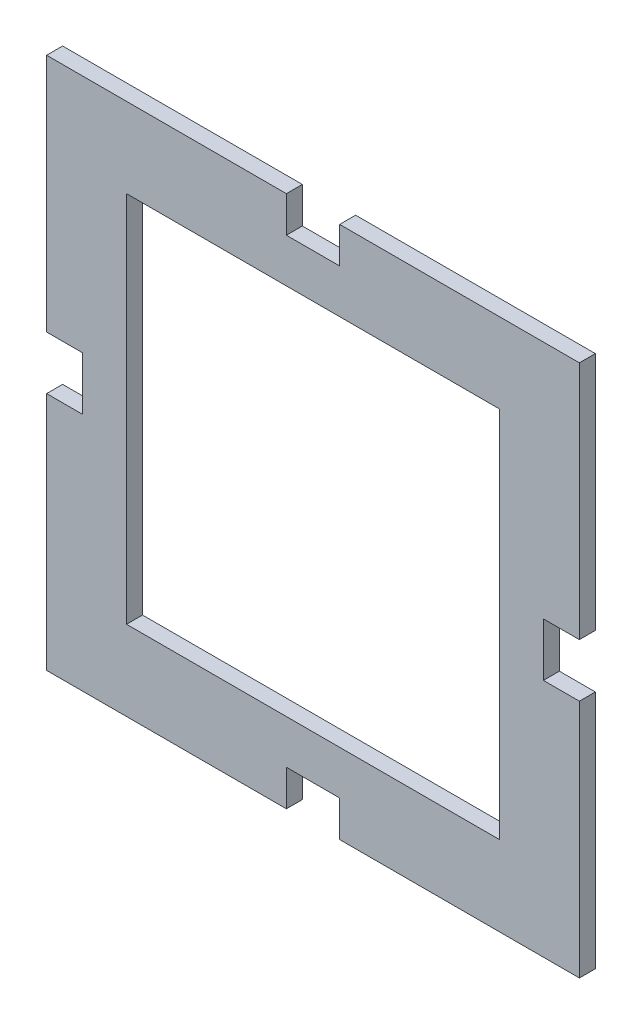
ISO-10303-21;
HEADER;
FILE_DESCRIPTION(('STEP AP214'),'2;1');
FILE_NAME('part.step','',(''),(''),'','','');
FILE_SCHEMA(('AUTOMOTIVE_DESIGN { 1 0 10303 214 1 1 1 1 }'));
ENDSEC;
DATA;
#1=APPLICATION_CONTEXT('core data for automotive mechanical design processes');
#2=APPLICATION_PROTOCOL_DEFINITION('international standard','automotive_design',2000,#1);
#3=PRODUCT_CONTEXT('',#1,'mechanical');
#4=PRODUCT('Part','Part','',(#3));
#5=PRODUCT_RELATED_PRODUCT_CATEGORY('part','',(#4));
#6=PRODUCT_DEFINITION_FORMATION('','',#4);
#7=PRODUCT_DEFINITION_CONTEXT('part definition',#1,'design');
#8=PRODUCT_DEFINITION('design','',#6,#7);
#9=PRODUCT_DEFINITION_SHAPE('','',#8);
#10=(LENGTH_UNIT() NAMED_UNIT(*) SI_UNIT(.MILLI.,.METRE.));
#11=(NAMED_UNIT(*) PLANE_ANGLE_UNIT() SI_UNIT($,.RADIAN.));
#12=(NAMED_UNIT(*) SI_UNIT($,.STERADIAN.) SOLID_ANGLE_UNIT());
#13=UNCERTAINTY_MEASURE_WITH_UNIT(LENGTH_MEASURE(1.E-05),#10,'distance_accuracy_value','');
#14=(GEOMETRIC_REPRESENTATION_CONTEXT(3) GLOBAL_UNCERTAINTY_ASSIGNED_CONTEXT((#13)) GLOBAL_UNIT_ASSIGNED_CONTEXT((#10,
#11,#12)) REPRESENTATION_CONTEXT('',''));
#15=CARTESIAN_POINT('',(0.,0.,0.));
#16=DIRECTION('',(0.,0.,1.));
#17=DIRECTION('',(1.,0.,0.));
#18=AXIS2_PLACEMENT_3D('',#15,#16,#17);
#19=CARTESIAN_POINT('',(50.,0.,3.));
#20=DIRECTION('',(1.,0.,0.));
#21=DIRECTION('',(0.,0.,-1.));
#22=AXIS2_PLACEMENT_3D('',#19,#20,#21);
#23=PLANE('',#22);
#24=DIRECTION('',(0.,-1.,0.));
#25=VECTOR('',#24,1.);
#26=CARTESIAN_POINT('',(50.,0.,0.));
#27=LINE('',#26,#25);
#28=CARTESIAN_POINT('',(50.,-4.99999999999998,0.));
#29=VERTEX_POINT('',#28);
#30=CARTESIAN_POINT('',(50.,-50.,0.));
#31=VERTEX_POINT('',#30);
#32=EDGE_CURVE('E242',#29,#31,#27,.T.);
#33=ORIENTED_EDGE('',*,*,#32,.F.);
#34=DIRECTION('',(0.,0.,-1.));
#35=VECTOR('',#34,1.);
#36=CARTESIAN_POINT('',(50.,-4.99999999999998,3.));
#37=LINE('',#36,#35);
#38=CARTESIAN_POINT('',(50.,-4.99999999999998,3.));
#39=VERTEX_POINT('',#38);
#40=EDGE_CURVE('E11',#39,#29,#37,.T.);
#41=ORIENTED_EDGE('',*,*,#40,.F.);
#42=DIRECTION('',(0.,-1.,0.));
#43=VECTOR('',#42,1.);
#44=CARTESIAN_POINT('',(50.,0.,3.));
#45=LINE('',#44,#43);
#46=CARTESIAN_POINT('',(50.,-50.,3.));
#47=VERTEX_POINT('',#46);
#48=EDGE_CURVE('E405',#39,#47,#45,.T.);
#49=ORIENTED_EDGE('',*,*,#48,.T.);
#50=DIRECTION('',(0.,0.,-1.));
#51=VECTOR('',#50,1.);
#52=CARTESIAN_POINT('',(50.,-50.,3.));
#53=LINE('',#52,#51);
#54=EDGE_CURVE('E135',#47,#31,#53,.T.);
#55=ORIENTED_EDGE('',*,*,#54,.T.);
#56=EDGE_LOOP('',(#33,#41,#49,#55));
#57=FACE_BOUND('',#56,.T.);
#58=ADVANCED_FACE('F34',(#57),#23,.T.);
#59=CARTESIAN_POINT('',(0.,-4.99999999999998,3.));
#60=DIRECTION('',(0.,-1.,0.));
#61=DIRECTION('',(0.,0.,-1.));
#62=AXIS2_PLACEMENT_3D('',#59,#60,#61);
#63=PLANE('',#62);
#64=DIRECTION('',(-1.,0.,0.));
#65=VECTOR('',#64,1.);
#66=CARTESIAN_POINT('',(0.,-4.99999999999998,0.));
#67=LINE('',#66,#65);
#68=CARTESIAN_POINT('',(43.24,-4.99999999999998,0.));
#69=VERTEX_POINT('',#68);
#70=EDGE_CURVE('E245',#29,#69,#67,.T.);
#71=ORIENTED_EDGE('',*,*,#70,.T.);
#72=DIRECTION('',(0.,0.,-1.));
#73=VECTOR('',#72,1.);
#74=CARTESIAN_POINT('',(43.24,-4.99999999999998,3.));
#75=LINE('',#74,#73);
#76=CARTESIAN_POINT('',(43.24,-4.99999999999998,3.));
#77=VERTEX_POINT('',#76);
#78=EDGE_CURVE('E44',#77,#69,#75,.T.);
#79=ORIENTED_EDGE('',*,*,#78,.F.);
#80=DIRECTION('',(-1.,0.,0.));
#81=VECTOR('',#80,1.);
#82=CARTESIAN_POINT('',(0.,-4.99999999999998,3.));
#83=LINE('',#82,#81);
#84=EDGE_CURVE('E449',#39,#77,#83,.T.);
#85=ORIENTED_EDGE('',*,*,#84,.F.);
#86=ORIENTED_EDGE('',*,*,#40,.T.);
#87=EDGE_LOOP('',(#71,#79,#85,#86));
#88=FACE_BOUND('',#87,.T.);
#89=ADVANCED_FACE('F362',(#88),#63,.F.);
#90=CARTESIAN_POINT('',(43.24,0.,3.));
#91=DIRECTION('',(-1.,0.,0.));
#92=DIRECTION('',(0.,0.,1.));
#93=AXIS2_PLACEMENT_3D('',#90,#91,#92);
#94=PLANE('',#93);
#95=DIRECTION('',(0.,1.,0.));
#96=VECTOR('',#95,1.);
#97=CARTESIAN_POINT('',(43.24,0.,0.));
#98=LINE('',#97,#96);
#99=CARTESIAN_POINT('',(43.24,5.00000000000002,0.));
#100=VERTEX_POINT('',#99);
#101=EDGE_CURVE('E249',#69,#100,#98,.T.);
#102=ORIENTED_EDGE('',*,*,#101,.T.);
#103=DIRECTION('',(0.,0.,-1.));
#104=VECTOR('',#103,1.);
#105=CARTESIAN_POINT('',(43.24,5.00000000000002,3.));
#106=LINE('',#105,#104);
#107=CARTESIAN_POINT('',(43.24,5.00000000000002,3.));
#108=VERTEX_POINT('',#107);
#109=EDGE_CURVE('E324',#108,#100,#106,.T.);
#110=ORIENTED_EDGE('',*,*,#109,.F.);
#111=DIRECTION('',(0.,1.,0.));
#112=VECTOR('',#111,1.);
#113=CARTESIAN_POINT('',(43.24,0.,3.));
#114=LINE('',#113,#112);
#115=EDGE_CURVE('E452',#77,#108,#114,.T.);
#116=ORIENTED_EDGE('',*,*,#115,.F.);
#117=ORIENTED_EDGE('',*,*,#78,.T.);
#118=EDGE_LOOP('',(#102,#110,#116,#117));
#119=FACE_BOUND('',#118,.T.);
#120=ADVANCED_FACE('F368',(#119),#94,.F.);
#121=CARTESIAN_POINT('',(0.,5.00000000000007,3.));
#122=DIRECTION('',(0.,-1.,0.));
#123=DIRECTION('',(1.,0.,0.));
#124=AXIS2_PLACEMENT_3D('',#121,#122,#123);
#125=PLANE('',#124);
#126=DIRECTION('',(-1.,0.,0.));
#127=VECTOR('',#126,1.);
#128=CARTESIAN_POINT('',(0.,5.00000000000007,0.));
#129=LINE('',#128,#127);
#130=CARTESIAN_POINT('',(50.,5.00000000000002,0.));
#131=VERTEX_POINT('',#130);
#132=EDGE_CURVE('E252',#131,#100,#129,.T.);
#133=ORIENTED_EDGE('',*,*,#132,.F.);
#134=DIRECTION('',(0.,0.,-1.));
#135=VECTOR('',#134,1.);
#136=CARTESIAN_POINT('',(50.,5.00000000000002,3.));
#137=LINE('',#136,#135);
#138=CARTESIAN_POINT('',(50.,5.00000000000002,3.));
#139=VERTEX_POINT('',#138);
#140=EDGE_CURVE('E322',#139,#131,#137,.T.);
#141=ORIENTED_EDGE('',*,*,#140,.F.);
#142=DIRECTION('',(-1.,0.,0.));
#143=VECTOR('',#142,1.);
#144=CARTESIAN_POINT('',(0.,5.00000000000007,3.));
#145=LINE('',#144,#143);
#146=EDGE_CURVE('E403',#139,#108,#145,.T.);
#147=ORIENTED_EDGE('',*,*,#146,.T.);
#148=ORIENTED_EDGE('',*,*,#109,.T.);
#149=EDGE_LOOP('',(#133,#141,#147,#148));
#150=FACE_BOUND('',#149,.T.);
#151=ADVANCED_FACE('F375',(#150),#125,.T.);
#152=CARTESIAN_POINT('',(50.,50.,0.));
#153=VERTEX_POINT('',#152);
#154=EDGE_CURVE('E246',#153,#131,#27,.T.);
#155=ORIENTED_EDGE('',*,*,#154,.F.);
#156=DIRECTION('',(0.,0.,-1.));
#157=VECTOR('',#156,1.);
#158=CARTESIAN_POINT('',(50.,50.,3.));
#159=LINE('',#158,#157);
#160=CARTESIAN_POINT('',(50.,50.,3.));
#161=VERTEX_POINT('',#160);
#162=EDGE_CURVE('E320',#161,#153,#159,.T.);
#163=ORIENTED_EDGE('',*,*,#162,.F.);
#164=EDGE_CURVE('E398',#161,#139,#45,.T.);
#165=ORIENTED_EDGE('',*,*,#164,.T.);
#166=ORIENTED_EDGE('',*,*,#140,.T.);
#167=EDGE_LOOP('',(#155,#163,#165,#166));
#168=FACE_BOUND('',#167,.T.);
#169=ADVANCED_FACE('F364',(#168),#23,.T.);
#170=CARTESIAN_POINT('',(0.,50.,3.));
#171=DIRECTION('',(0.,1.,0.));
#172=DIRECTION('',(0.,0.,1.));
#173=AXIS2_PLACEMENT_3D('',#170,#171,#172);
#174=PLANE('',#173);
#175=DIRECTION('',(1.,0.,0.));
#176=VECTOR('',#175,1.);
#177=CARTESIAN_POINT('',(0.,50.,0.));
#178=LINE('',#177,#176);
#179=CARTESIAN_POINT('',(5.,50.,0.));
#180=VERTEX_POINT('',#179);
#181=EDGE_CURVE('E255',#180,#153,#178,.T.);
#182=ORIENTED_EDGE('',*,*,#181,.F.);
#183=DIRECTION('',(0.,0.,-1.));
#184=VECTOR('',#183,1.);
#185=CARTESIAN_POINT('',(5.,50.,3.));
#186=LINE('',#185,#184);
#187=CARTESIAN_POINT('',(5.,50.,3.));
#188=VERTEX_POINT('',#187);
#189=EDGE_CURVE('E318',#188,#180,#186,.T.);
#190=ORIENTED_EDGE('',*,*,#189,.F.);
#191=DIRECTION('',(1.,0.,0.));
#192=VECTOR('',#191,1.);
#193=CARTESIAN_POINT('',(0.,50.,3.));
#194=LINE('',#193,#192);
#195=EDGE_CURVE('E396',#188,#161,#194,.T.);
#196=ORIENTED_EDGE('',*,*,#195,.T.);
#197=ORIENTED_EDGE('',*,*,#162,.T.);
#198=EDGE_LOOP('',(#182,#190,#196,#197));
#199=FACE_BOUND('',#198,.T.);
#200=ADVANCED_FACE('F374',(#199),#174,.T.);
#201=CARTESIAN_POINT('',(5.00000000000002,0.,3.));
#202=DIRECTION('',(1.,0.,0.));
#203=DIRECTION('',(0.,1.,0.));
#204=AXIS2_PLACEMENT_3D('',#201,#202,#203);
#205=PLANE('',#204);
#206=DIRECTION('',(0.,-1.,0.));
#207=VECTOR('',#206,1.);
#208=CARTESIAN_POINT('',(5.00000000000002,0.,0.));
#209=LINE('',#208,#207);
#210=CARTESIAN_POINT('',(5.,43.24,0.));
#211=VERTEX_POINT('',#210);
#212=EDGE_CURVE('E258',#180,#211,#209,.T.);
#213=ORIENTED_EDGE('',*,*,#212,.T.);
#214=DIRECTION('',(0.,0.,-1.));
#215=VECTOR('',#214,1.);
#216=CARTESIAN_POINT('',(5.,43.24,3.));
#217=LINE('',#216,#215);
#218=CARTESIAN_POINT('',(5.,43.24,3.));
#219=VERTEX_POINT('',#218);
#220=EDGE_CURVE('E316',#219,#211,#217,.T.);
#221=ORIENTED_EDGE('',*,*,#220,.F.);
#222=DIRECTION('',(0.,-1.,0.));
#223=VECTOR('',#222,1.);
#224=CARTESIAN_POINT('',(5.00000000000002,0.,3.));
#225=LINE('',#224,#223);
#226=EDGE_CURVE('E397',#188,#219,#225,.T.);
#227=ORIENTED_EDGE('',*,*,#226,.F.);
#228=ORIENTED_EDGE('',*,*,#189,.T.);
#229=EDGE_LOOP('',(#213,#221,#227,#228));
#230=FACE_BOUND('',#229,.T.);
#231=ADVANCED_FACE('F381',(#230),#205,.F.);
#232=CARTESIAN_POINT('',(0.,43.24,3.));
#233=DIRECTION('',(0.,1.,0.));
#234=DIRECTION('',(0.,0.,1.));
#235=AXIS2_PLACEMENT_3D('',#232,#233,#234);
#236=PLANE('',#235);
#237=DIRECTION('',(1.,0.,0.));
#238=VECTOR('',#237,1.);
#239=CARTESIAN_POINT('',(0.,43.24,0.));
#240=LINE('',#239,#238);
#241=CARTESIAN_POINT('',(-5.,43.24,0.));
#242=VERTEX_POINT('',#241);
#243=EDGE_CURVE('E262',#242,#211,#240,.T.);
#244=ORIENTED_EDGE('',*,*,#243,.F.);
#245=DIRECTION('',(0.,0.,-1.));
#246=VECTOR('',#245,1.);
#247=CARTESIAN_POINT('',(-5.,43.24,3.));
#248=LINE('',#247,#246);
#249=CARTESIAN_POINT('',(-5.,43.24,3.));
#250=VERTEX_POINT('',#249);
#251=EDGE_CURVE('E314',#250,#242,#248,.T.);
#252=ORIENTED_EDGE('',*,*,#251,.F.);
#253=DIRECTION('',(1.,0.,0.));
#254=VECTOR('',#253,1.);
#255=CARTESIAN_POINT('',(0.,43.24,3.));
#256=LINE('',#255,#254);
#257=EDGE_CURVE('E401',#250,#219,#256,.T.);
#258=ORIENTED_EDGE('',*,*,#257,.T.);
#259=ORIENTED_EDGE('',*,*,#220,.T.);
#260=EDGE_LOOP('',(#244,#252,#258,#259));
#261=FACE_BOUND('',#260,.T.);
#262=ADVANCED_FACE('F488',(#261),#236,.T.);
#263=CARTESIAN_POINT('',(-4.99999999999999,0.,3.));
#264=DIRECTION('',(1.,0.,0.));
#265=DIRECTION('',(0.,1.,0.));
#266=AXIS2_PLACEMENT_3D('',#263,#264,#265);
#267=PLANE('',#266);
#268=DIRECTION('',(0.,-1.,0.));
#269=VECTOR('',#268,1.);
#270=CARTESIAN_POINT('',(-4.99999999999999,0.,0.));
#271=LINE('',#270,#269);
#272=CARTESIAN_POINT('',(-5.,50.,0.));
#273=VERTEX_POINT('',#272);
#274=EDGE_CURVE('E265',#273,#242,#271,.T.);
#275=ORIENTED_EDGE('',*,*,#274,.F.);
#276=DIRECTION('',(0.,0.,-1.));
#277=VECTOR('',#276,1.);
#278=CARTESIAN_POINT('',(-5.,50.,3.));
#279=LINE('',#278,#277);
#280=CARTESIAN_POINT('',(-5.,50.,3.));
#281=VERTEX_POINT('',#280);
#282=EDGE_CURVE('E312',#281,#273,#279,.T.);
#283=ORIENTED_EDGE('',*,*,#282,.F.);
#284=DIRECTION('',(0.,-1.,0.));
#285=VECTOR('',#284,1.);
#286=CARTESIAN_POINT('',(-4.99999999999999,0.,3.));
#287=LINE('',#286,#285);
#288=EDGE_CURVE('E409',#281,#250,#287,.T.);
#289=ORIENTED_EDGE('',*,*,#288,.T.);
#290=ORIENTED_EDGE('',*,*,#251,.T.);
#291=EDGE_LOOP('',(#275,#283,#289,#290));
#292=FACE_BOUND('',#291,.T.);
#293=ADVANCED_FACE('F497',(#292),#267,.T.);
#294=CARTESIAN_POINT('',(-50.,50.,0.));
#295=VERTEX_POINT('',#294);
#296=EDGE_CURVE('E259',#295,#273,#178,.T.);
#297=ORIENTED_EDGE('',*,*,#296,.F.);
#298=DIRECTION('',(0.,0.,-1.));
#299=VECTOR('',#298,1.);
#300=CARTESIAN_POINT('',(-50.,50.,3.));
#301=LINE('',#300,#299);
#302=CARTESIAN_POINT('',(-50.,50.,3.));
#303=VERTEX_POINT('',#302);
#304=EDGE_CURVE('E310',#303,#295,#301,.T.);
#305=ORIENTED_EDGE('',*,*,#304,.F.);
#306=EDGE_CURVE('E400',#303,#281,#194,.T.);
#307=ORIENTED_EDGE('',*,*,#306,.T.);
#308=ORIENTED_EDGE('',*,*,#282,.T.);
#309=EDGE_LOOP('',(#297,#305,#307,#308));
#310=FACE_BOUND('',#309,.T.);
#311=ADVANCED_FACE('F384',(#310),#174,.T.);
#312=CARTESIAN_POINT('',(-50.,0.,3.));
#313=DIRECTION('',(1.,0.,0.));
#314=DIRECTION('',(0.,0.,-1.));
#315=AXIS2_PLACEMENT_3D('',#312,#313,#314);
#316=PLANE('',#315);
#317=DIRECTION('',(0.,-1.,0.));
#318=VECTOR('',#317,1.);
#319=CARTESIAN_POINT('',(-50.,0.,0.));
#320=LINE('',#319,#318);
#321=CARTESIAN_POINT('',(-50.,5.,0.));
#322=VERTEX_POINT('',#321);
#323=EDGE_CURVE('E268',#295,#322,#320,.T.);
#324=ORIENTED_EDGE('',*,*,#323,.T.);
#325=DIRECTION('',(0.,0.,-1.));
#326=VECTOR('',#325,1.);
#327=CARTESIAN_POINT('',(-50.,5.,3.));
#328=LINE('',#327,#326);
#329=CARTESIAN_POINT('',(-50.,5.,3.));
#330=VERTEX_POINT('',#329);
#331=EDGE_CURVE('E307',#330,#322,#328,.T.);
#332=ORIENTED_EDGE('',*,*,#331,.F.);
#333=DIRECTION('',(0.,-1.,0.));
#334=VECTOR('',#333,1.);
#335=CARTESIAN_POINT('',(-50.,0.,3.));
#336=LINE('',#335,#334);
#337=EDGE_CURVE('E408',#303,#330,#336,.T.);
#338=ORIENTED_EDGE('',*,*,#337,.F.);
#339=ORIENTED_EDGE('',*,*,#304,.T.);
#340=EDGE_LOOP('',(#324,#332,#338,#339));
#341=FACE_BOUND('',#340,.T.);
#342=ADVANCED_FACE('F515',(#341),#316,.F.);
#343=CARTESIAN_POINT('',(0.,5.,3.));
#344=DIRECTION('',(0.,1.,0.));
#345=DIRECTION('',(0.,0.,1.));
#346=AXIS2_PLACEMENT_3D('',#343,#344,#345);
#347=PLANE('',#346);
#348=DIRECTION('',(1.,0.,0.));
#349=VECTOR('',#348,1.);
#350=CARTESIAN_POINT('',(0.,5.,0.));
#351=LINE('',#350,#349);
#352=CARTESIAN_POINT('',(-43.24,5.,0.));
#353=VERTEX_POINT('',#352);
#354=EDGE_CURVE('E271',#322,#353,#351,.T.);
#355=ORIENTED_EDGE('',*,*,#354,.T.);
#356=DIRECTION('',(0.,0.,-1.));
#357=VECTOR('',#356,1.);
#358=CARTESIAN_POINT('',(-43.24,5.,3.));
#359=LINE('',#358,#357);
#360=CARTESIAN_POINT('',(-43.24,5.,3.));
#361=VERTEX_POINT('',#360);
#362=EDGE_CURVE('E304',#361,#353,#359,.T.);
#363=ORIENTED_EDGE('',*,*,#362,.F.);
#364=DIRECTION('',(1.,0.,0.));
#365=VECTOR('',#364,1.);
#366=CARTESIAN_POINT('',(0.,5.,3.));
#367=LINE('',#366,#365);
#368=EDGE_CURVE('E413',#330,#361,#367,.T.);
#369=ORIENTED_EDGE('',*,*,#368,.F.);
#370=ORIENTED_EDGE('',*,*,#331,.T.);
#371=EDGE_LOOP('',(#355,#363,#369,#370));
#372=FACE_BOUND('',#371,.T.);
#373=ADVANCED_FACE('F523',(#372),#347,.F.);
#374=CARTESIAN_POINT('',(-43.24,0.,3.));
#375=DIRECTION('',(1.,0.,0.));
#376=DIRECTION('',(0.,0.,-1.));
#377=AXIS2_PLACEMENT_3D('',#374,#375,#376);
#378=PLANE('',#377);
#379=DIRECTION('',(0.,-1.,0.));
#380=VECTOR('',#379,1.);
#381=CARTESIAN_POINT('',(-43.24,0.,0.));
#382=LINE('',#381,#380);
#383=CARTESIAN_POINT('',(-43.24,-5.,0.));
#384=VERTEX_POINT('',#383);
#385=EDGE_CURVE('E275',#353,#384,#382,.T.);
#386=ORIENTED_EDGE('',*,*,#385,.T.);
#387=DIRECTION('',(0.,0.,-1.));
#388=VECTOR('',#387,1.);
#389=CARTESIAN_POINT('',(-43.24,-5.,3.));
#390=LINE('',#389,#388);
#391=CARTESIAN_POINT('',(-43.24,-5.,3.));
#392=VERTEX_POINT('',#391);
#393=EDGE_CURVE('E302',#392,#384,#390,.T.);
#394=ORIENTED_EDGE('',*,*,#393,.F.);
#395=DIRECTION('',(0.,-1.,0.));
#396=VECTOR('',#395,1.);
#397=CARTESIAN_POINT('',(-43.24,0.,3.));
#398=LINE('',#397,#396);
#399=EDGE_CURVE('E425',#361,#392,#398,.T.);
#400=ORIENTED_EDGE('',*,*,#399,.F.);
#401=ORIENTED_EDGE('',*,*,#362,.T.);
#402=EDGE_LOOP('',(#386,#394,#400,#401));
#403=FACE_BOUND('',#402,.T.);
#404=ADVANCED_FACE('F533',(#403),#378,.F.);
#405=CARTESIAN_POINT('',(0.,-5.,3.));
#406=DIRECTION('',(0.,1.,0.));
#407=DIRECTION('',(0.,0.,1.));
#408=AXIS2_PLACEMENT_3D('',#405,#406,#407);
#409=PLANE('',#408);
#410=DIRECTION('',(1.,0.,0.));
#411=VECTOR('',#410,1.);
#412=CARTESIAN_POINT('',(0.,-5.,0.));
#413=LINE('',#412,#411);
#414=CARTESIAN_POINT('',(-50.,-5.,0.));
#415=VERTEX_POINT('',#414);
#416=EDGE_CURVE('E278',#415,#384,#413,.T.);
#417=ORIENTED_EDGE('',*,*,#416,.F.);
#418=DIRECTION('',(0.,0.,-1.));
#419=VECTOR('',#418,1.);
#420=CARTESIAN_POINT('',(-50.,-5.,3.));
#421=LINE('',#420,#419);
#422=CARTESIAN_POINT('',(-50.,-5.,3.));
#423=VERTEX_POINT('',#422);
#424=EDGE_CURVE('E300',#423,#415,#421,.T.);
#425=ORIENTED_EDGE('',*,*,#424,.F.);
#426=DIRECTION('',(1.,0.,0.));
#427=VECTOR('',#426,1.);
#428=CARTESIAN_POINT('',(0.,-5.,3.));
#429=LINE('',#428,#427);
#430=EDGE_CURVE('E427',#423,#392,#429,.T.);
#431=ORIENTED_EDGE('',*,*,#430,.T.);
#432=ORIENTED_EDGE('',*,*,#393,.T.);
#433=EDGE_LOOP('',(#417,#425,#431,#432));
#434=FACE_BOUND('',#433,.T.);
#435=ADVANCED_FACE('F543',(#434),#409,.T.);
#436=CARTESIAN_POINT('',(-50.,-50.,0.));
#437=VERTEX_POINT('',#436);
#438=EDGE_CURVE('E272',#415,#437,#320,.T.);
#439=ORIENTED_EDGE('',*,*,#438,.T.);
#440=DIRECTION('',(0.,0.,-1.));
#441=VECTOR('',#440,1.);
#442=CARTESIAN_POINT('',(-50.,-50.,3.));
#443=LINE('',#442,#441);
#444=CARTESIAN_POINT('',(-50.,-50.,3.));
#445=VERTEX_POINT('',#444);
#446=EDGE_CURVE('E297',#445,#437,#443,.T.);
#447=ORIENTED_EDGE('',*,*,#446,.F.);
#448=EDGE_CURVE('E415',#423,#445,#336,.T.);
#449=ORIENTED_EDGE('',*,*,#448,.F.);
#450=ORIENTED_EDGE('',*,*,#424,.T.);
#451=EDGE_LOOP('',(#439,#447,#449,#450));
#452=FACE_BOUND('',#451,.T.);
#453=ADVANCED_FACE('F436',(#452),#316,.F.);
#454=CARTESIAN_POINT('',(0.,-50.,3.));
#455=DIRECTION('',(0.,1.,0.));
#456=DIRECTION('',(0.,0.,1.));
#457=AXIS2_PLACEMENT_3D('',#454,#455,#456);
#458=PLANE('',#457);
#459=DIRECTION('',(1.,0.,0.));
#460=VECTOR('',#459,1.);
#461=CARTESIAN_POINT('',(0.,-50.,0.));
#462=LINE('',#461,#460);
#463=CARTESIAN_POINT('',(-5.00000000000002,-50.,0.));
#464=VERTEX_POINT('',#463);
#465=EDGE_CURVE('E281',#437,#464,#462,.T.);
#466=ORIENTED_EDGE('',*,*,#465,.T.);
#467=DIRECTION('',(0.,0.,-1.));
#468=VECTOR('',#467,1.);
#469=CARTESIAN_POINT('',(-5.00000000000002,-50.,3.));
#470=LINE('',#469,#468);
#471=CARTESIAN_POINT('',(-5.00000000000002,-50.,3.));
#472=VERTEX_POINT('',#471);
#473=EDGE_CURVE('E294',#472,#464,#470,.T.);
#474=ORIENTED_EDGE('',*,*,#473,.F.);
#475=DIRECTION('',(1.,0.,0.));
#476=VECTOR('',#475,1.);
#477=CARTESIAN_POINT('',(0.,-50.,3.));
#478=LINE('',#477,#476);
#479=EDGE_CURVE('E228',#445,#472,#478,.T.);
#480=ORIENTED_EDGE('',*,*,#479,.F.);
#481=ORIENTED_EDGE('',*,*,#446,.T.);
#482=EDGE_LOOP('',(#466,#474,#480,#481));
#483=FACE_BOUND('',#482,.T.);
#484=ADVANCED_FACE('F439',(#483),#458,.F.);
#485=CARTESIAN_POINT('',(-5.00000000000002,0.,3.));
#486=DIRECTION('',(-1.,0.,0.));
#487=DIRECTION('',(0.,0.,1.));
#488=AXIS2_PLACEMENT_3D('',#485,#486,#487);
#489=PLANE('',#488);
#490=DIRECTION('',(0.,1.,0.));
#491=VECTOR('',#490,1.);
#492=CARTESIAN_POINT('',(-5.00000000000002,0.,0.));
#493=LINE('',#492,#491);
#494=CARTESIAN_POINT('',(-5.00000000000002,-43.24,0.));
#495=VERTEX_POINT('',#494);
#496=EDGE_CURVE('E284',#464,#495,#493,.T.);
#497=ORIENTED_EDGE('',*,*,#496,.T.);
#498=DIRECTION('',(0.,0.,-1.));
#499=VECTOR('',#498,1.);
#500=CARTESIAN_POINT('',(-5.00000000000002,-43.24,3.));
#501=LINE('',#500,#499);
#502=CARTESIAN_POINT('',(-5.00000000000002,-43.24,3.));
#503=VERTEX_POINT('',#502);
#504=EDGE_CURVE('E216',#503,#495,#501,.T.);
#505=ORIENTED_EDGE('',*,*,#504,.F.);
#506=DIRECTION('',(0.,1.,0.));
#507=VECTOR('',#506,1.);
#508=CARTESIAN_POINT('',(-5.00000000000002,0.,3.));
#509=LINE('',#508,#507);
#510=EDGE_CURVE('E221',#472,#503,#509,.T.);
#511=ORIENTED_EDGE('',*,*,#510,.F.);
#512=ORIENTED_EDGE('',*,*,#473,.T.);
#513=EDGE_LOOP('',(#497,#505,#511,#512));
#514=FACE_BOUND('',#513,.T.);
#515=ADVANCED_FACE('F441',(#514),#489,.F.);
#516=CARTESIAN_POINT('',(0.,-43.24,3.));
#517=DIRECTION('',(0.,-1.,0.));
#518=DIRECTION('',(1.,0.,0.));
#519=AXIS2_PLACEMENT_3D('',#516,#517,#518);
#520=PLANE('',#519);
#521=DIRECTION('',(-1.,0.,0.));
#522=VECTOR('',#521,1.);
#523=CARTESIAN_POINT('',(0.,-43.24,0.));
#524=LINE('',#523,#522);
#525=CARTESIAN_POINT('',(4.99999999999998,-43.24,0.));
#526=VERTEX_POINT('',#525);
#527=EDGE_CURVE('E211',#526,#495,#524,.T.);
#528=ORIENTED_EDGE('',*,*,#527,.F.);
#529=DIRECTION('',(0.,0.,-1.));
#530=VECTOR('',#529,1.);
#531=CARTESIAN_POINT('',(4.99999999999998,-43.24,3.));
#532=LINE('',#531,#530);
#533=CARTESIAN_POINT('',(4.99999999999998,-43.24,3.));
#534=VERTEX_POINT('',#533);
#535=EDGE_CURVE('E206',#534,#526,#532,.T.);
#536=ORIENTED_EDGE('',*,*,#535,.F.);
#537=DIRECTION('',(-1.,0.,0.));
#538=VECTOR('',#537,1.);
#539=CARTESIAN_POINT('',(0.,-43.24,3.));
#540=LINE('',#539,#538);
#541=EDGE_CURVE('E209',#534,#503,#540,.T.);
#542=ORIENTED_EDGE('',*,*,#541,.T.);
#543=ORIENTED_EDGE('',*,*,#504,.T.);
#544=EDGE_LOOP('',(#528,#536,#542,#543));
#545=FACE_BOUND('',#544,.T.);
#546=ADVANCED_FACE('F208',(#545),#520,.T.);
#547=CARTESIAN_POINT('',(4.99999999999998,0.,3.));
#548=DIRECTION('',(-1.,0.,0.));
#549=DIRECTION('',(0.,0.,1.));
#550=AXIS2_PLACEMENT_3D('',#547,#548,#549);
#551=PLANE('',#550);
#552=DIRECTION('',(0.,1.,0.));
#553=VECTOR('',#552,1.);
#554=CARTESIAN_POINT('',(4.99999999999998,0.,0.));
#555=LINE('',#554,#553);
#556=CARTESIAN_POINT('',(4.99999999999998,-50.,0.));
#557=VERTEX_POINT('',#556);
#558=EDGE_CURVE('E289',#557,#526,#555,.T.);
#559=ORIENTED_EDGE('',*,*,#558,.F.);
#560=DIRECTION('',(0.,0.,-1.));
#561=VECTOR('',#560,1.);
#562=CARTESIAN_POINT('',(4.99999999999998,-50.,3.));
#563=LINE('',#562,#561);
#564=CARTESIAN_POINT('',(4.99999999999998,-50.,3.));
#565=VERTEX_POINT('',#564);
#566=EDGE_CURVE('E128',#565,#557,#563,.T.);
#567=ORIENTED_EDGE('',*,*,#566,.F.);
#568=DIRECTION('',(0.,1.,0.));
#569=VECTOR('',#568,1.);
#570=CARTESIAN_POINT('',(4.99999999999998,0.,3.));
#571=LINE('',#570,#569);
#572=EDGE_CURVE('E219',#565,#534,#571,.T.);
#573=ORIENTED_EDGE('',*,*,#572,.T.);
#574=ORIENTED_EDGE('',*,*,#535,.T.);
#575=EDGE_LOOP('',(#559,#567,#573,#574));
#576=FACE_BOUND('',#575,.T.);
#577=ADVANCED_FACE('F224',(#576),#551,.T.);
#578=CARTESIAN_POINT('',(-35.,0.,3.));
#579=DIRECTION('',(1.,0.,0.));
#580=DIRECTION('',(0.,0.,-1.));
#581=AXIS2_PLACEMENT_3D('',#578,#579,#580);
#582=PLANE('',#581);
#583=DIRECTION('',(0.,-1.,0.));
#584=VECTOR('',#583,1.);
#585=CARTESIAN_POINT('',(-35.,0.,0.));
#586=LINE('',#585,#584);
#587=CARTESIAN_POINT('',(-35.,35.,0.));
#588=VERTEX_POINT('',#587);
#589=CARTESIAN_POINT('',(-35.,-35.,0.));
#590=VERTEX_POINT('',#589);
#591=EDGE_CURVE('E231',#588,#590,#586,.T.);
#592=ORIENTED_EDGE('',*,*,#591,.F.);
#593=DIRECTION('',(0.,0.,-1.));
#594=VECTOR('',#593,1.);
#595=CARTESIAN_POINT('',(-35.,35.,3.));
#596=LINE('',#595,#594);
#597=CARTESIAN_POINT('',(-35.,35.,3.));
#598=VERTEX_POINT('',#597);
#599=EDGE_CURVE('E38',#598,#588,#596,.T.);
#600=ORIENTED_EDGE('',*,*,#599,.F.);
#601=DIRECTION('',(0.,-1.,0.));
#602=VECTOR('',#601,1.);
#603=CARTESIAN_POINT('',(-35.,0.,3.));
#604=LINE('',#603,#602);
#605=CARTESIAN_POINT('',(-35.,-35.,3.));
#606=VERTEX_POINT('',#605);
#607=EDGE_CURVE('E345',#598,#606,#604,.T.);
#608=ORIENTED_EDGE('',*,*,#607,.T.);
#609=DIRECTION('',(0.,0.,-1.));
#610=VECTOR('',#609,1.);
#611=CARTESIAN_POINT('',(-35.,-35.,3.));
#612=LINE('',#611,#610);
#613=EDGE_CURVE('E226',#606,#590,#612,.T.);
#614=ORIENTED_EDGE('',*,*,#613,.T.);
#615=EDGE_LOOP('',(#592,#600,#608,#614));
#616=FACE_BOUND('',#615,.T.);
#617=ADVANCED_FACE('F36',(#616),#582,.T.);
#618=CARTESIAN_POINT('',(0.,35.,3.));
#619=DIRECTION('',(0.,1.,0.));
#620=DIRECTION('',(0.,0.,1.));
#621=AXIS2_PLACEMENT_3D('',#618,#619,#620);
#622=PLANE('',#621);
#623=DIRECTION('',(1.,0.,0.));
#624=VECTOR('',#623,1.);
#625=CARTESIAN_POINT('',(0.,35.,0.));
#626=LINE('',#625,#624);
#627=CARTESIAN_POINT('',(35.,35.,0.));
#628=VERTEX_POINT('',#627);
#629=EDGE_CURVE('E234',#588,#628,#626,.T.);
#630=ORIENTED_EDGE('',*,*,#629,.T.);
#631=DIRECTION('',(0.,0.,-1.));
#632=VECTOR('',#631,1.);
#633=CARTESIAN_POINT('',(35.,35.,3.));
#634=LINE('',#633,#632);
#635=CARTESIAN_POINT('',(35.,35.,3.));
#636=VERTEX_POINT('',#635);
#637=EDGE_CURVE('E330',#636,#628,#634,.T.);
#638=ORIENTED_EDGE('',*,*,#637,.F.);
#639=DIRECTION('',(1.,0.,0.));
#640=VECTOR('',#639,1.);
#641=CARTESIAN_POINT('',(0.,35.,3.));
#642=LINE('',#641,#640);
#643=EDGE_CURVE('E339',#598,#636,#642,.T.);
#644=ORIENTED_EDGE('',*,*,#643,.F.);
#645=ORIENTED_EDGE('',*,*,#599,.T.);
#646=EDGE_LOOP('',(#630,#638,#644,#645));
#647=FACE_BOUND('',#646,.T.);
#648=ADVANCED_FACE('F338',(#647),#622,.F.);
#649=CARTESIAN_POINT('',(35.,0.,3.));
#650=DIRECTION('',(1.,0.,0.));
#651=DIRECTION('',(0.,0.,-1.));
#652=AXIS2_PLACEMENT_3D('',#649,#650,#651);
#653=PLANE('',#652);
#654=DIRECTION('',(0.,-1.,0.));
#655=VECTOR('',#654,1.);
#656=CARTESIAN_POINT('',(35.,0.,0.));
#657=LINE('',#656,#655);
#658=CARTESIAN_POINT('',(35.,-35.,0.));
#659=VERTEX_POINT('',#658);
#660=EDGE_CURVE('E236',#628,#659,#657,.T.);
#661=ORIENTED_EDGE('',*,*,#660,.T.);
#662=DIRECTION('',(0.,0.,-1.));
#663=VECTOR('',#662,1.);
#664=CARTESIAN_POINT('',(35.,-35.,3.));
#665=LINE('',#664,#663);
#666=CARTESIAN_POINT('',(35.,-35.,3.));
#667=VERTEX_POINT('',#666);
#668=EDGE_CURVE('E329',#667,#659,#665,.T.);
#669=ORIENTED_EDGE('',*,*,#668,.F.);
#670=DIRECTION('',(0.,-1.,0.));
#671=VECTOR('',#670,1.);
#672=CARTESIAN_POINT('',(35.,0.,3.));
#673=LINE('',#672,#671);
#674=EDGE_CURVE('E444',#636,#667,#673,.T.);
#675=ORIENTED_EDGE('',*,*,#674,.F.);
#676=ORIENTED_EDGE('',*,*,#637,.T.);
#677=EDGE_LOOP('',(#661,#669,#675,#676));
#678=FACE_BOUND('',#677,.T.);
#679=ADVANCED_FACE('F352',(#678),#653,.F.);
#680=CARTESIAN_POINT('',(0.,-35.,3.));
#681=DIRECTION('',(0.,1.,0.));
#682=DIRECTION('',(0.,0.,1.));
#683=AXIS2_PLACEMENT_3D('',#680,#681,#682);
#684=PLANE('',#683);
#685=DIRECTION('',(1.,0.,0.));
#686=VECTOR('',#685,1.);
#687=CARTESIAN_POINT('',(0.,-35.,0.));
#688=LINE('',#687,#686);
#689=EDGE_CURVE('E239',#590,#659,#688,.T.);
#690=ORIENTED_EDGE('',*,*,#689,.F.);
#691=ORIENTED_EDGE('',*,*,#613,.F.);
#692=DIRECTION('',(1.,0.,0.));
#693=VECTOR('',#692,1.);
#694=CARTESIAN_POINT('',(0.,-35.,3.));
#695=LINE('',#694,#693);
#696=EDGE_CURVE('E350',#606,#667,#695,.T.);
#697=ORIENTED_EDGE('',*,*,#696,.T.);
#698=ORIENTED_EDGE('',*,*,#668,.T.);
#699=EDGE_LOOP('',(#690,#691,#697,#698));
#700=FACE_BOUND('',#699,.T.);
#701=ADVANCED_FACE('F349',(#700),#684,.T.);
#702=EDGE_CURVE('E285',#557,#31,#462,.T.);
#703=ORIENTED_EDGE('',*,*,#702,.T.);
#704=ORIENTED_EDGE('',*,*,#54,.F.);
#705=EDGE_CURVE('E53',#565,#47,#478,.T.);
#706=ORIENTED_EDGE('',*,*,#705,.F.);
#707=ORIENTED_EDGE('',*,*,#566,.T.);
#708=EDGE_LOOP('',(#703,#704,#706,#707));
#709=FACE_BOUND('',#708,.T.);
#710=ADVANCED_FACE('F359',(#709),#458,.F.);
#711=CARTESIAN_POINT('',(0.,0.,3.));
#712=DIRECTION('',(0.,0.,1.));
#713=DIRECTION('',(1.,0.,0.));
#714=AXIS2_PLACEMENT_3D('',#711,#712,#713);
#715=PLANE('',#714);
#716=ORIENTED_EDGE('',*,*,#607,.F.);
#717=ORIENTED_EDGE('',*,*,#643,.T.);
#718=ORIENTED_EDGE('',*,*,#674,.T.);
#719=ORIENTED_EDGE('',*,*,#696,.F.);
#720=EDGE_LOOP('',(#716,#717,#718,#719));
#721=FACE_BOUND('',#720,.T.);
#722=ORIENTED_EDGE('',*,*,#48,.F.);
#723=ORIENTED_EDGE('',*,*,#84,.T.);
#724=ORIENTED_EDGE('',*,*,#115,.T.);
#725=ORIENTED_EDGE('',*,*,#146,.F.);
#726=ORIENTED_EDGE('',*,*,#164,.F.);
#727=ORIENTED_EDGE('',*,*,#195,.F.);
#728=ORIENTED_EDGE('',*,*,#226,.T.);
#729=ORIENTED_EDGE('',*,*,#257,.F.);
#730=ORIENTED_EDGE('',*,*,#288,.F.);
#731=ORIENTED_EDGE('',*,*,#306,.F.);
#732=ORIENTED_EDGE('',*,*,#337,.T.);
#733=ORIENTED_EDGE('',*,*,#368,.T.);
#734=ORIENTED_EDGE('',*,*,#399,.T.);
#735=ORIENTED_EDGE('',*,*,#430,.F.);
#736=ORIENTED_EDGE('',*,*,#448,.T.);
#737=ORIENTED_EDGE('',*,*,#479,.T.);
#738=ORIENTED_EDGE('',*,*,#510,.T.);
#739=ORIENTED_EDGE('',*,*,#541,.F.);
#740=ORIENTED_EDGE('',*,*,#572,.F.);
#741=ORIENTED_EDGE('',*,*,#705,.T.);
#742=EDGE_LOOP('',(#722,#723,#724,#725,#726,#727,#728,#729,#730,#731,#732,#733,#734,#735,#736,
#737,#738,#739,#740,#741));
#743=FACE_BOUND('',#742,.T.);
#744=ADVANCED_FACE('F218',(#721,#743),#715,.T.);
#745=CARTESIAN_POINT('',(0.,0.,0.));
#746=DIRECTION('',(0.,0.,1.));
#747=DIRECTION('',(1.,0.,0.));
#748=AXIS2_PLACEMENT_3D('',#745,#746,#747);
#749=PLANE('',#748);
#750=ORIENTED_EDGE('',*,*,#591,.T.);
#751=ORIENTED_EDGE('',*,*,#689,.T.);
#752=ORIENTED_EDGE('',*,*,#660,.F.);
#753=ORIENTED_EDGE('',*,*,#629,.F.);
#754=EDGE_LOOP('',(#750,#751,#752,#753));
#755=FACE_BOUND('',#754,.T.);
#756=ORIENTED_EDGE('',*,*,#32,.T.);
#757=ORIENTED_EDGE('',*,*,#702,.F.);
#758=ORIENTED_EDGE('',*,*,#558,.T.);
#759=ORIENTED_EDGE('',*,*,#527,.T.);
#760=ORIENTED_EDGE('',*,*,#496,.F.);
#761=ORIENTED_EDGE('',*,*,#465,.F.);
#762=ORIENTED_EDGE('',*,*,#438,.F.);
#763=ORIENTED_EDGE('',*,*,#416,.T.);
#764=ORIENTED_EDGE('',*,*,#385,.F.);
#765=ORIENTED_EDGE('',*,*,#354,.F.);
#766=ORIENTED_EDGE('',*,*,#323,.F.);
#767=ORIENTED_EDGE('',*,*,#296,.T.);
#768=ORIENTED_EDGE('',*,*,#274,.T.);
#769=ORIENTED_EDGE('',*,*,#243,.T.);
#770=ORIENTED_EDGE('',*,*,#212,.F.);
#771=ORIENTED_EDGE('',*,*,#181,.T.);
#772=ORIENTED_EDGE('',*,*,#154,.T.);
#773=ORIENTED_EDGE('',*,*,#132,.T.);
#774=ORIENTED_EDGE('',*,*,#101,.F.);
#775=ORIENTED_EDGE('',*,*,#70,.F.);
#776=EDGE_LOOP('',(#756,#757,#758,#759,#760,#761,#762,#763,#764,#765,#766,#767,#768,#769,#770,
#771,#772,#773,#774,#775));
#777=FACE_BOUND('',#776,.T.);
#778=ADVANCED_FACE('F342',(#755,#777),#749,.F.);
#779=CLOSED_SHELL('',(#58,#89,#120,#151,#169,#200,#231,#262,#293,#311,#342,#373,#404,#435,#453,
#484,#515,#546,#577,#617,#648,#679,#701,#710,#744,#778));
#780=MANIFOLD_SOLID_BREP('B2',#779);
#781=ADVANCED_BREP_SHAPE_REPRESENTATION('',(#18,#780),#14);
#782=SHAPE_DEFINITION_REPRESENTATION(#9,#781);
ENDSEC;
END-ISO-10303-21;
